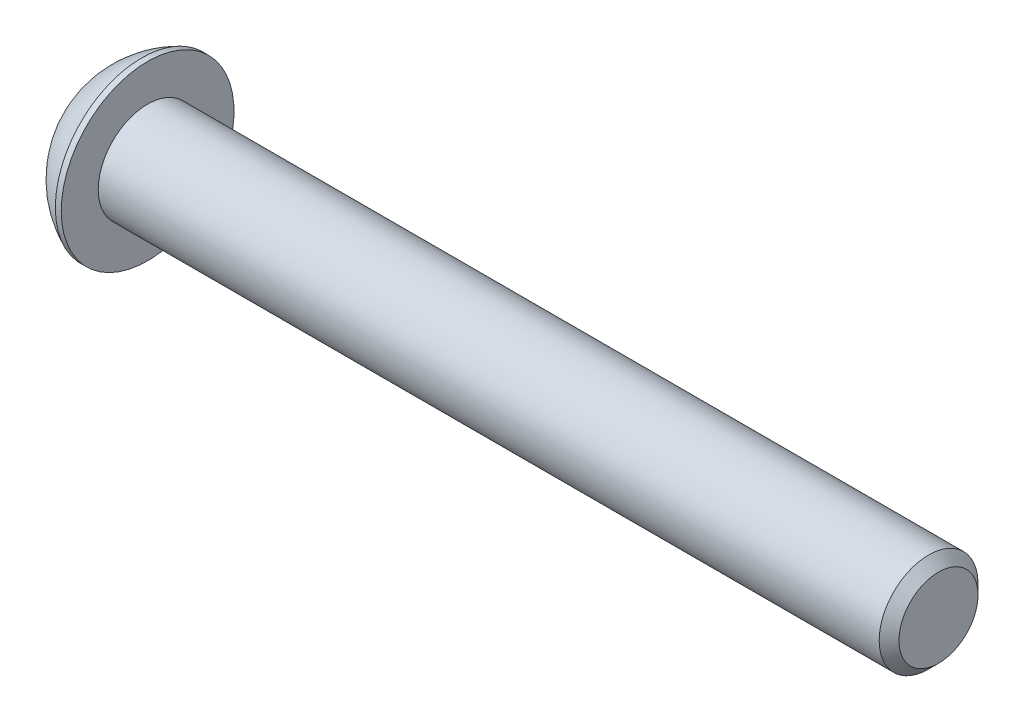
ISO-10303-21;
HEADER;
FILE_DESCRIPTION(('STEP AP214'),'2;1');
FILE_NAME('part.step','',(''),(''),'','','');
FILE_SCHEMA(('AUTOMOTIVE_DESIGN { 1 0 10303 214 1 1 1 1 }'));
ENDSEC;
DATA;
#1=APPLICATION_CONTEXT('core data for automotive mechanical design processes');
#2=APPLICATION_PROTOCOL_DEFINITION('international standard','automotive_design',2000,#1);
#3=PRODUCT_CONTEXT('',#1,'mechanical');
#4=PRODUCT('Part','Part','',(#3));
#5=PRODUCT_RELATED_PRODUCT_CATEGORY('part','',(#4));
#6=PRODUCT_DEFINITION_FORMATION('','',#4);
#7=PRODUCT_DEFINITION_CONTEXT('part definition',#1,'design');
#8=PRODUCT_DEFINITION('design','',#6,#7);
#9=PRODUCT_DEFINITION_SHAPE('','',#8);
#10=(LENGTH_UNIT() NAMED_UNIT(*) SI_UNIT(.MILLI.,.METRE.));
#11=(NAMED_UNIT(*) PLANE_ANGLE_UNIT() SI_UNIT($,.RADIAN.));
#12=(NAMED_UNIT(*) SI_UNIT($,.STERADIAN.) SOLID_ANGLE_UNIT());
#13=UNCERTAINTY_MEASURE_WITH_UNIT(LENGTH_MEASURE(1.E-05),#10,'distance_accuracy_value','');
#14=(GEOMETRIC_REPRESENTATION_CONTEXT(3) GLOBAL_UNCERTAINTY_ASSIGNED_CONTEXT((#13)) GLOBAL_UNIT_ASSIGNED_CONTEXT((#10,
#11,#12)) REPRESENTATION_CONTEXT('',''));
#15=CARTESIAN_POINT('',(0.,0.,0.));
#16=DIRECTION('',(0.,0.,1.));
#17=DIRECTION('',(1.,0.,0.));
#18=AXIS2_PLACEMENT_3D('',#15,#16,#17);
#19=CARTESIAN_POINT('',(1.32080000000034,0.,0.));
#20=DIRECTION('',(-1.,0.,0.));
#21=DIRECTION('',(0.,0.,1.));
#22=AXIS2_PLACEMENT_3D('',#19,#20,#21);
#23=CONICAL_SURFACE('',#22,1.1937999999998,1.04719755119608);
#24=CARTESIAN_POINT('',(2.01004075135902,0.,-4.44089209850063E-13));
#25=VERTEX_POINT('',#24);
#26=VERTEX_LOOP('',#25);
#27=FACE_BOUND('',#26,.T.);
#28=CARTESIAN_POINT('',(1.32080000000009,0.,0.));
#29=DIRECTION('',(-1.,0.,0.));
#30=DIRECTION('',(0.,0.,1.));
#31=AXIS2_PLACEMENT_3D('',#28,#29,#30);
#32=CIRCLE('',#31,1.19380000000024);
#33=CARTESIAN_POINT('',(1.32080000000009,0.,1.19380000000024));
#34=VERTEX_POINT('',#33);
#35=EDGE_CURVE('E20',#34,#34,#32,.T.);
#36=ORIENTED_EDGE('',*,*,#35,.T.);
#37=EDGE_LOOP('',(#36));
#38=FACE_BOUND('',#37,.T.);
#39=ADVANCED_FACE('F17',(#27,#38),#23,.F.);
#40=CARTESIAN_POINT('',(1.3208,-2.29135888084633,0.));
#41=DIRECTION('',(1.,0.,0.));
#42=DIRECTION('',(0.,0.,-1.));
#43=AXIS2_PLACEMENT_3D('',#40,#41,#42);
#44=PLANE('',#43);
#45=DIRECTION('',(0.,1.,0.));
#46=VECTOR('',#45,1.);
#47=CARTESIAN_POINT('',(1.3208,-1.14567944042316,1.984375));
#48=LINE('',#47,#46);
#49=CARTESIAN_POINT('',(1.3208,1.14567944042316,1.984375));
#50=VERTEX_POINT('',#49);
#51=CARTESIAN_POINT('',(1.3208,-1.14567944042316,1.984375));
#52=VERTEX_POINT('',#51);
#53=EDGE_CURVE('E69',#50,#52,#48,.F.);
#54=ORIENTED_EDGE('',*,*,#53,.F.);
#55=DIRECTION('',(0.,0.5,-0.866025403784439));
#56=VECTOR('',#55,1.);
#57=CARTESIAN_POINT('',(1.3208,1.14567944042316,1.984375));
#58=LINE('',#57,#56);
#59=CARTESIAN_POINT('',(1.3208,2.29135888084633,0.));
#60=VERTEX_POINT('',#59);
#61=EDGE_CURVE('E287',#60,#50,#58,.F.);
#62=ORIENTED_EDGE('',*,*,#61,.F.);
#63=DIRECTION('',(0.,-0.5,-0.866025403784439));
#64=VECTOR('',#63,1.);
#65=CARTESIAN_POINT('',(1.3208,2.29135888084633,0.));
#66=LINE('',#65,#64);
#67=CARTESIAN_POINT('',(1.3208,1.14567944042316,-1.984375));
#68=VERTEX_POINT('',#67);
#69=EDGE_CURVE('E291',#68,#60,#66,.F.);
#70=ORIENTED_EDGE('',*,*,#69,.F.);
#71=DIRECTION('',(0.,1.,0.));
#72=VECTOR('',#71,1.);
#73=CARTESIAN_POINT('',(1.3208,1.14567944042316,-1.984375));
#74=LINE('',#73,#72);
#75=CARTESIAN_POINT('',(1.3208,-1.14567944042316,-1.984375));
#76=VERTEX_POINT('',#75);
#77=EDGE_CURVE('E296',#76,#68,#74,.T.);
#78=ORIENTED_EDGE('',*,*,#77,.F.);
#79=DIRECTION('',(0.,-0.500000000000001,0.866025403784438));
#80=VECTOR('',#79,1.);
#81=CARTESIAN_POINT('',(1.3208,-1.14567944042316,-1.984375));
#82=LINE('',#81,#80);
#83=CARTESIAN_POINT('',(1.3208,-2.29135888084633,0.));
#84=VERTEX_POINT('',#83);
#85=EDGE_CURVE('E301',#84,#76,#82,.F.);
#86=ORIENTED_EDGE('',*,*,#85,.F.);
#87=DIRECTION('',(0.,0.500000000000001,0.866025403784438));
#88=VECTOR('',#87,1.);
#89=CARTESIAN_POINT('',(1.3208,-2.29135888084633,0.));
#90=LINE('',#89,#88);
#91=EDGE_CURVE('E82',#52,#84,#90,.F.);
#92=ORIENTED_EDGE('',*,*,#91,.F.);
#93=EDGE_LOOP('',(#54,#62,#70,#78,#86,#92));
#94=FACE_BOUND('',#93,.T.);
#95=ORIENTED_EDGE('',*,*,#35,.F.);
#96=EDGE_LOOP('',(#95));
#97=FACE_BOUND('',#96,.T.);
#98=ADVANCED_FACE('F75',(#94,#97),#44,.F.);
#99=CARTESIAN_POINT('',(1.3208,-1.14567944042316,1.984375));
#100=DIRECTION('',(0.,0.,-1.));
#101=DIRECTION('',(0.,1.,0.));
#102=AXIS2_PLACEMENT_3D('',#99,#100,#101);
#103=PLANE('',#102);
#104=ORIENTED_EDGE('',*,*,#53,.T.);
#105=DIRECTION('',(1.,0.,0.));
#106=VECTOR('',#105,1.);
#107=CARTESIAN_POINT('',(1.3208,-1.14567944042316,1.984375));
#108=LINE('',#107,#106);
#109=CARTESIAN_POINT('',(0.,-1.14567944042316,1.984375));
#110=VERTEX_POINT('',#109);
#111=EDGE_CURVE('E79',#110,#52,#108,.T.);
#112=ORIENTED_EDGE('',*,*,#111,.F.);
#113=DIRECTION('',(0.,1.,0.));
#114=VECTOR('',#113,1.);
#115=CARTESIAN_POINT('',(0.,0.,1.984375));
#116=LINE('',#115,#114);
#117=CARTESIAN_POINT('',(0.,1.14567944042316,1.984375));
#118=VERTEX_POINT('',#117);
#119=EDGE_CURVE('E281',#118,#110,#116,.F.);
#120=ORIENTED_EDGE('',*,*,#119,.F.);
#121=DIRECTION('',(1.,0.,0.));
#122=VECTOR('',#121,1.);
#123=CARTESIAN_POINT('',(1.3208,1.14567944042316,1.984375));
#124=LINE('',#123,#122);
#125=EDGE_CURVE('E284',#50,#118,#124,.F.);
#126=ORIENTED_EDGE('',*,*,#125,.F.);
#127=EDGE_LOOP('',(#104,#112,#120,#126));
#128=FACE_BOUND('',#127,.T.);
#129=ADVANCED_FACE('F128',(#128),#103,.T.);
#130=CARTESIAN_POINT('',(1.3208,-2.29135888084633,0.));
#131=DIRECTION('',(0.,0.866025403784438,-0.500000000000001));
#132=DIRECTION('',(0.,0.500000000000001,0.866025403784438));
#133=AXIS2_PLACEMENT_3D('',#130,#131,#132);
#134=PLANE('',#133);
#135=ORIENTED_EDGE('',*,*,#91,.T.);
#136=DIRECTION('',(1.,0.,0.));
#137=VECTOR('',#136,1.);
#138=CARTESIAN_POINT('',(1.3208,-2.29135888084633,0.));
#139=LINE('',#138,#137);
#140=CARTESIAN_POINT('',(0.,-2.29135888084633,0.));
#141=VERTEX_POINT('',#140);
#142=EDGE_CURVE('E303',#141,#84,#139,.T.);
#143=ORIENTED_EDGE('',*,*,#142,.F.);
#144=DIRECTION('',(0.,-0.500000000000001,-0.866025403784438));
#145=VECTOR('',#144,1.);
#146=CARTESIAN_POINT('',(0.,-1.14567944042316,1.984375));
#147=LINE('',#146,#145);
#148=EDGE_CURVE('E278',#110,#141,#147,.T.);
#149=ORIENTED_EDGE('',*,*,#148,.F.);
#150=ORIENTED_EDGE('',*,*,#111,.T.);
#151=EDGE_LOOP('',(#135,#143,#149,#150));
#152=FACE_BOUND('',#151,.T.);
#153=ADVANCED_FACE('F124',(#152),#134,.T.);
#154=CARTESIAN_POINT('',(1.3208,-1.14567944042316,-1.984375));
#155=DIRECTION('',(0.,0.866025403784438,0.500000000000001));
#156=DIRECTION('',(0.,-0.500000000000001,0.866025403784438));
#157=AXIS2_PLACEMENT_3D('',#154,#155,#156);
#158=PLANE('',#157);
#159=ORIENTED_EDGE('',*,*,#85,.T.);
#160=DIRECTION('',(1.,0.,0.));
#161=VECTOR('',#160,1.);
#162=CARTESIAN_POINT('',(1.3208,-1.14567944042316,-1.984375));
#163=LINE('',#162,#161);
#164=CARTESIAN_POINT('',(0.,-1.14567944042316,-1.984375));
#165=VERTEX_POINT('',#164);
#166=EDGE_CURVE('E298',#165,#76,#163,.T.);
#167=ORIENTED_EDGE('',*,*,#166,.F.);
#168=DIRECTION('',(0.,0.500000000000001,-0.866025403784438));
#169=VECTOR('',#168,1.);
#170=CARTESIAN_POINT('',(0.,-2.29135888084633,0.));
#171=LINE('',#170,#169);
#172=EDGE_CURVE('E275',#141,#165,#171,.T.);
#173=ORIENTED_EDGE('',*,*,#172,.F.);
#174=ORIENTED_EDGE('',*,*,#142,.T.);
#175=EDGE_LOOP('',(#159,#167,#173,#174));
#176=FACE_BOUND('',#175,.T.);
#177=ADVANCED_FACE('F120',(#176),#158,.T.);
#178=CARTESIAN_POINT('',(1.3208,1.14567944042316,-1.984375));
#179=DIRECTION('',(0.,0.,1.));
#180=DIRECTION('',(1.,0.,0.));
#181=AXIS2_PLACEMENT_3D('',#178,#179,#180);
#182=PLANE('',#181);
#183=ORIENTED_EDGE('',*,*,#77,.T.);
#184=DIRECTION('',(1.,0.,0.));
#185=VECTOR('',#184,1.);
#186=CARTESIAN_POINT('',(1.3208,1.14567944042316,-1.984375));
#187=LINE('',#186,#185);
#188=CARTESIAN_POINT('',(0.,1.14567944042316,-1.984375));
#189=VERTEX_POINT('',#188);
#190=EDGE_CURVE('E293',#189,#68,#187,.T.);
#191=ORIENTED_EDGE('',*,*,#190,.F.);
#192=DIRECTION('',(0.,1.,0.));
#193=VECTOR('',#192,1.);
#194=CARTESIAN_POINT('',(0.,0.,-1.984375));
#195=LINE('',#194,#193);
#196=EDGE_CURVE('E272',#165,#189,#195,.T.);
#197=ORIENTED_EDGE('',*,*,#196,.F.);
#198=ORIENTED_EDGE('',*,*,#166,.T.);
#199=EDGE_LOOP('',(#183,#191,#197,#198));
#200=FACE_BOUND('',#199,.T.);
#201=ADVANCED_FACE('F117',(#200),#182,.T.);
#202=CARTESIAN_POINT('',(1.3208,2.29135888084633,0.));
#203=DIRECTION('',(0.,-0.866025403784439,0.5));
#204=DIRECTION('',(0.,-0.5,-0.866025403784439));
#205=AXIS2_PLACEMENT_3D('',#202,#203,#204);
#206=PLANE('',#205);
#207=ORIENTED_EDGE('',*,*,#69,.T.);
#208=DIRECTION('',(1.,0.,0.));
#209=VECTOR('',#208,1.);
#210=CARTESIAN_POINT('',(1.3208,2.29135888084633,0.));
#211=LINE('',#210,#209);
#212=CARTESIAN_POINT('',(0.,2.29135888084633,0.));
#213=VERTEX_POINT('',#212);
#214=EDGE_CURVE('E35',#213,#60,#211,.T.);
#215=ORIENTED_EDGE('',*,*,#214,.F.);
#216=DIRECTION('',(0.,0.5,0.866025403784439));
#217=VECTOR('',#216,1.);
#218=CARTESIAN_POINT('',(0.,1.14567944042316,-1.984375));
#219=LINE('',#218,#217);
#220=EDGE_CURVE('E269',#189,#213,#219,.T.);
#221=ORIENTED_EDGE('',*,*,#220,.F.);
#222=ORIENTED_EDGE('',*,*,#190,.T.);
#223=EDGE_LOOP('',(#207,#215,#221,#222));
#224=FACE_BOUND('',#223,.T.);
#225=ADVANCED_FACE('F113',(#224),#206,.T.);
#226=CARTESIAN_POINT('',(1.3208,1.14567944042316,1.984375));
#227=DIRECTION('',(0.,-0.866025403784439,-0.5));
#228=DIRECTION('',(0.,0.5,-0.866025403784439));
#229=AXIS2_PLACEMENT_3D('',#226,#227,#228);
#230=PLANE('',#229);
#231=ORIENTED_EDGE('',*,*,#61,.T.);
#232=ORIENTED_EDGE('',*,*,#125,.T.);
#233=DIRECTION('',(0.,-0.5,0.866025403784438));
#234=VECTOR('',#233,1.);
#235=CARTESIAN_POINT('',(0.,2.29135888084633,0.));
#236=LINE('',#235,#234);
#237=EDGE_CURVE('E100',#213,#118,#236,.T.);
#238=ORIENTED_EDGE('',*,*,#237,.F.);
#239=ORIENTED_EDGE('',*,*,#214,.T.);
#240=EDGE_LOOP('',(#231,#232,#238,#239));
#241=FACE_BOUND('',#240,.T.);
#242=ADVANCED_FACE('F109',(#241),#230,.T.);
#243=CARTESIAN_POINT('',(0.,0.,0.));
#244=DIRECTION('',(-1.,0.,0.));
#245=DIRECTION('',(0.,0.,1.));
#246=AXIS2_PLACEMENT_3D('',#243,#244,#245);
#247=PLANE('',#246);
#248=ORIENTED_EDGE('',*,*,#220,.T.);
#249=ORIENTED_EDGE('',*,*,#237,.T.);
#250=ORIENTED_EDGE('',*,*,#119,.T.);
#251=ORIENTED_EDGE('',*,*,#148,.T.);
#252=ORIENTED_EDGE('',*,*,#172,.T.);
#253=ORIENTED_EDGE('',*,*,#196,.T.);
#254=EDGE_LOOP('',(#248,#249,#250,#251,#252,#253));
#255=FACE_BOUND('',#254,.T.);
#256=CARTESIAN_POINT('',(0.,2.77495,0.));
#257=CARTESIAN_POINT('',(0.,2.77494953309947,0.0779118937523459));
#258=CARTESIAN_POINT('',(0.,2.77166578388025,0.15583810591977));
#259=CARTESIAN_POINT('',(0.,2.75855213600204,0.311152012455904));
#260=CARTESIAN_POINT('',(0.,2.74872030471467,0.388539541019556));
#261=CARTESIAN_POINT('',(0.,2.72255472645676,0.542341518735717));
#262=CARTESIAN_POINT('',(-2.70414110576258E-13,2.70621065843663,0.618754223567578));
#263=CARTESIAN_POINT('',(2.71501725221868E-13,2.66713326915777,0.769973634286023));
#264=CARTESIAN_POINT('',(1.01274952524446E-12,2.64439476297869,0.844778983646282));
#265=CARTESIAN_POINT('',(1.81909959813207E-12,2.56690195943351,1.06566239301792));
#266=CARTESIAN_POINT('',(4.77081687541822E-13,2.50280672569928,1.20857954243987));
#267=CARTESIAN_POINT('',(-4.76232447128612E-13,2.35149826934097,1.48160874561538));
#268=CARTESIAN_POINT('',(0.,2.26428416790397,1.61172031233499));
#269=CARTESIAN_POINT('',(0.,2.1181093928834,1.79445660654268));
#270=CARTESIAN_POINT('',(0.,2.06678693791626,1.85333128513996));
#271=CARTESIAN_POINT('',(0.,1.95940522984449,1.96650727912792));
#272=CARTESIAN_POINT('',(0.,1.90335059143535,2.02081294920044));
#273=CARTESIAN_POINT('',(0.,1.78683891013963,2.12453280878582));
#274=CARTESIAN_POINT('',(0.,1.72637988450322,2.1739447713554));
#275=CARTESIAN_POINT('',(0.,1.60151968865711,2.26750481692908));
#276=CARTESIAN_POINT('',(0.,1.53711760864537,2.31165167810847));
#277=CARTESIAN_POINT('',(0.,1.33869902291632,2.43567242603944));
#278=CARTESIAN_POINT('',(0.,1.19934704110695,2.507235886628));
#279=CARTESIAN_POINT('',(0.,0.910681609121881,2.62590828672821));
#280=CARTESIAN_POINT('',(0.,0.761368265357398,2.67301748742278));
#281=CARTESIAN_POINT('',(0.,0.456932649466623,2.74151230664007));
#282=CARTESIAN_POINT('',(0.,0.301810346322584,2.76289778778721));
#283=CARTESIAN_POINT('',(0.,-0.00982263870895171,2.77931595661156));
#284=CARTESIAN_POINT('',(0.,-0.166333320596448,2.77434864428877));
#285=CARTESIAN_POINT('',(0.,-0.476280836814452,2.73822217653073));
#286=CARTESIAN_POINT('',(0.,-0.629717687555985,2.70706316096981));
#287=CARTESIAN_POINT('',(0.,-0.929254830044274,2.61937980771149));
#288=CARTESIAN_POINT('',(0.,-1.0753550434132,2.56285519909568));
#289=CARTESIAN_POINT('',(0.,-1.28570692598579,2.46037024128109));
#290=CARTESIAN_POINT('',(0.,-1.35439130022287,2.42323494812896));
#291=CARTESIAN_POINT('',(0.,-1.488391287199,2.34331277270256));
#292=CARTESIAN_POINT('',(0.,-1.55370767631787,2.30052720108831));
#293=CARTESIAN_POINT('',(0.,-1.68047292776594,2.20962421887055));
#294=CARTESIAN_POINT('',(0.,-1.7419235278682,2.16150923122348));
#295=CARTESIAN_POINT('',(0.,-1.86060297067992,2.06024311301283));
#296=CARTESIAN_POINT('',(0.,-1.91782768181715,2.0070871669763));
#297=CARTESIAN_POINT('',(0.,-2.08239462196651,1.8407220856554));
#298=CARTESIAN_POINT('',(0.,-2.18279764272601,1.72049499758422));
#299=CARTESIAN_POINT('',(0.,-2.36195754944063,1.46487629213018));
#300=CARTESIAN_POINT('',(0.,-2.44071525816758,1.32948525142807));
#301=CARTESIAN_POINT('',(0.,-2.54098882695274,1.11796734074395));
#302=CARTESIAN_POINT('',(0.,-2.57146177392727,1.04596540008347));
#303=CARTESIAN_POINT('',(0.,-2.62621251108999,0.899689259475764));
#304=CARTESIAN_POINT('',(0.,-2.65049531495563,0.825416953360952));
#305=CARTESIAN_POINT('',(0.,-2.69267708798766,0.675215808695207));
#306=CARTESIAN_POINT('',(0.,-2.71058613777937,0.599289789313092));
#307=CARTESIAN_POINT('',(0.,-2.73994710360127,0.446213628496932));
#308=CARTESIAN_POINT('',(0.,-2.75140092413871,0.369063855024788));
#309=CARTESIAN_POINT('',(0.,-2.76470470685522,0.24316208817343));
#310=CARTESIAN_POINT('',(0.,-2.76854547596618,0.194611672428577));
#311=CARTESIAN_POINT('',(0.,-2.77366826843264,0.0973760351839812));
#312=CARTESIAN_POINT('',(0.,-2.77495029178814,0.0486908136842395));
#313=CARTESIAN_POINT('',(0.,-2.77494953309947,-0.0779118937523475));
#314=CARTESIAN_POINT('',(0.,-2.77166578388025,-0.155838105919772));
#315=CARTESIAN_POINT('',(0.,-2.75855213600204,-0.311152012455906));
#316=CARTESIAN_POINT('',(0.,-2.74872030471467,-0.388539541019558));
#317=CARTESIAN_POINT('',(0.,-2.72255472645677,-0.542341518735719));
#318=CARTESIAN_POINT('',(-2.70149297926331E-13,-2.70621065843663,-0.61875422356758));
#319=CARTESIAN_POINT('',(2.712366972268E-13,-2.66713326915777,-0.769973634286024));
#320=CARTESIAN_POINT('',(1.0114146773846E-12,-2.64439476297869,-0.844778983646283));
#321=CARTESIAN_POINT('',(1.81656702958366E-12,-2.5669019594335,-1.06566239301792));
#322=CARTESIAN_POINT('',(4.7641829195856E-13,-2.50280672569928,-1.20857954243988));
#323=CARTESIAN_POINT('',(-4.75569026324205E-13,-2.35149826934097,-1.48160874561538));
#324=CARTESIAN_POINT('',(0.,-2.26428416790396,-1.61172031233499));
#325=CARTESIAN_POINT('',(0.,-2.1181093928834,-1.79445660654268));
#326=CARTESIAN_POINT('',(0.,-2.06678693791626,-1.85333128513997));
#327=CARTESIAN_POINT('',(0.,-1.95940522984449,-1.96650727912792));
#328=CARTESIAN_POINT('',(0.,-1.90335059143535,-2.02081294920044));
#329=CARTESIAN_POINT('',(0.,-1.78683891013963,-2.12453280878582));
#330=CARTESIAN_POINT('',(0.,-1.72637988450322,-2.1739447713554));
#331=CARTESIAN_POINT('',(0.,-1.60151968865711,-2.26750481692908));
#332=CARTESIAN_POINT('',(0.,-1.53711760864537,-2.31165167810847));
#333=CARTESIAN_POINT('',(0.,-1.33869902291632,-2.43567242603944));
#334=CARTESIAN_POINT('',(0.,-1.19934704110695,-2.507235886628));
#335=CARTESIAN_POINT('',(0.,-0.91068160912188,-2.62590828672821));
#336=CARTESIAN_POINT('',(0.,-0.761368265357396,-2.67301748742278));
#337=CARTESIAN_POINT('',(0.,-0.456932649466621,-2.74151230664007));
#338=CARTESIAN_POINT('',(0.,-0.301810346322582,-2.76289778778721));
#339=CARTESIAN_POINT('',(0.,0.00982263870895353,-2.77931595661156));
#340=CARTESIAN_POINT('',(0.,0.16633332059645,-2.77434864428876));
#341=CARTESIAN_POINT('',(0.,0.476280836814454,-2.73822217653073));
#342=CARTESIAN_POINT('',(0.,0.629717687555987,-2.70706316096981));
#343=CARTESIAN_POINT('',(0.,0.929254830044276,-2.6193798077115));
#344=CARTESIAN_POINT('',(0.,1.0753550434132,-2.56285519909568));
#345=CARTESIAN_POINT('',(0.,1.28570692598579,-2.46037024128109));
#346=CARTESIAN_POINT('',(0.,1.35439130022287,-2.42323494812896));
#347=CARTESIAN_POINT('',(0.,1.488391287199,-2.34331277270256));
#348=CARTESIAN_POINT('',(0.,1.55370767631787,-2.30052720108831));
#349=CARTESIAN_POINT('',(0.,1.68047292776594,-2.20962421887055));
#350=CARTESIAN_POINT('',(0.,1.7419235278682,-2.16150923122348));
#351=CARTESIAN_POINT('',(0.,1.86060297067992,-2.06024311301282));
#352=CARTESIAN_POINT('',(0.,1.91782768181716,-2.0070871669763));
#353=CARTESIAN_POINT('',(0.,2.08239462196651,-1.8407220856554));
#354=CARTESIAN_POINT('',(0.,2.18279764272601,-1.72049499758422));
#355=CARTESIAN_POINT('',(0.,2.36195754944063,-1.46487629213018));
#356=CARTESIAN_POINT('',(0.,2.44071525816757,-1.32948525142807));
#357=CARTESIAN_POINT('',(0.,2.54098882695273,-1.11796734074395));
#358=CARTESIAN_POINT('',(0.,2.57146177392727,-1.04596540008347));
#359=CARTESIAN_POINT('',(0.,2.62621251108999,-0.899689259475765));
#360=CARTESIAN_POINT('',(0.,2.65049531495563,-0.825416953360953));
#361=CARTESIAN_POINT('',(0.,2.69267708798766,-0.675215808695207));
#362=CARTESIAN_POINT('',(0.,2.71058613777936,-0.599289789313092));
#363=CARTESIAN_POINT('',(0.,2.73994710360127,-0.446213628496932));
#364=CARTESIAN_POINT('',(0.,2.75140092413871,-0.369063855024789));
#365=CARTESIAN_POINT('',(0.,2.76470470685522,-0.243162088173432));
#366=CARTESIAN_POINT('',(0.,2.76854547596618,-0.194611672428578));
#367=CARTESIAN_POINT('',(0.,2.77366826843264,-0.0973760351839823));
#368=CARTESIAN_POINT('',(0.,2.77495029178814,-0.0486908136842408));
#369=CARTESIAN_POINT('',(0.,2.77495,0.));
#370=B_SPLINE_CURVE_WITH_KNOTS('',3,(#256,#257,#258,#259,#260,#261,#262,#263,#264,#265,#266,
#267,#268,#269,#270,#271,#272,#273,#274,#275,#276,#277,#278,#279,#280,#281,#282,#283,#284,#285,
#286,#287,#288,#289,#290,#291,#292,#293,#294,#295,#296,#297,#298,#299,#300,#301,#302,#303,#304,
#305,#306,#307,#308,#309,#310,#311,#312,#313,#314,#315,#316,#317,#318,#319,#320,#321,#322,#323,
#324,#325,#326,#327,#328,#329,#330,#331,#332,#333,#334,#335,#336,#337,#338,#339,#340,#341,#342,
#343,#344,#345,#346,#347,#348,#349,#350,#351,#352,#353,#354,#355,#356,#357,#358,#359,#360,#361,
#362,#363,#364,#365,#366,#367,#368,#369),.UNSPECIFIED.,.T.,.F.,(4,2,2,2,2,2,2,2,2,2,2,2,2,2,2,2,
2,2,2,2,2,2,2,2,2,2,2,2,2,2,2,2,2,2,2,2,2,2,2,2,2,2,2,2,2,2,2,2,2,2,2,2,2,2,2,2,4),(0.,
0.233690856748162,0.467450716578751,0.701582538521471,0.935904756015414,1.40343220467667,
1.87097742791502,2.10505636898837,2.33890962270652,2.57286880998746,2.80688218486306,
3.27442101763127,3.74195485676357,4.20949119271389,4.67702752866417,5.14456136779641,
5.61210020056468,5.84611357544033,6.08007276272136,6.31392601643949,6.54800495751273,
7.01555018075072,7.48307762941212,7.71739984690652,7.95153166884955,8.18529152868023,
8.41898238542855,8.56502681353347,8.71107124163843,8.94476209838659,9.17852195821718,
9.4126537801599,9.64697599765384,10.1145034463151,10.5820486695534,10.8161276106268,
11.0499808643449,11.2839400516259,11.5179534265015,11.9854922592697,12.453026098402,
12.9205624343523,13.3880987703026,13.8556326094348,14.3231714422031,14.5571848170788,
14.7911440043598,15.0249972580779,15.2590761991512,15.7266214223891,16.1941488710506,
16.4284710885449,16.662602910488,16.8963627703186,17.130053627067,17.2760980551719,
17.4221424832769),.UNSPECIFIED.);
#371=CARTESIAN_POINT('',(0.,2.77495,0.));
#372=VERTEX_POINT('',#371);
#373=EDGE_CURVE('E94',#372,#372,#370,.T.);
#374=ORIENTED_EDGE('',*,*,#373,.F.);
#375=EDGE_LOOP('',(#374));
#376=FACE_BOUND('',#375,.T.);
#377=ADVANCED_FACE('F105',(#255,#376),#247,.T.);
#378=CARTESIAN_POINT('',(5.37260881410256,0.,0.));
#379=DIRECTION('',(0.,1.,0.));
#380=DIRECTION('',(1.,0.,0.));
#381=AXIS2_PLACEMENT_3D('',#378,#379,#380);
#382=SPHERICAL_SURFACE('',#381,6.04692260342999);
#383=CARTESIAN_POINT('',(2.9718,0.,0.));
#384=DIRECTION('',(-1.,0.,0.));
#385=DIRECTION('',(0.,0.,1.));
#386=AXIS2_PLACEMENT_3D('',#383,#384,#385);
#387=CIRCLE('',#386,5.5499);
#388=CARTESIAN_POINT('',(2.9718,0.,5.5499));
#389=VERTEX_POINT('',#388);
#390=EDGE_CURVE('E92',#389,#389,#387,.F.);
#391=ORIENTED_EDGE('',*,*,#390,.F.);
#392=EDGE_LOOP('',(#391));
#393=FACE_BOUND('',#392,.T.);
#394=ORIENTED_EDGE('',*,*,#373,.T.);
#395=EDGE_LOOP('',(#394));
#396=FACE_BOUND('',#395,.T.);
#397=ADVANCED_FACE('F101',(#393,#396),#382,.T.);
#398=CARTESIAN_POINT('',(54.1528,0.,0.));
#399=DIRECTION('',(-1.,0.,0.));
#400=DIRECTION('',(0.,0.,1.));
#401=AXIS2_PLACEMENT_3D('',#398,#399,#400);
#402=PLANE('',#401);
#403=CARTESIAN_POINT('',(54.152800000054,0.,0.));
#404=DIRECTION('',(-1.,0.,0.));
#405=DIRECTION('',(0.,-1.,0.));
#406=AXIS2_PLACEMENT_3D('',#403,#404,#405);
#407=CIRCLE('',#406,2.53999999995358);
#408=CARTESIAN_POINT('',(54.152800000054,-2.53999999995358,0.));
#409=VERTEX_POINT('',#408);
#410=EDGE_CURVE('E89',#409,#409,#407,.T.);
#411=ORIENTED_EDGE('',*,*,#410,.F.);
#412=EDGE_LOOP('',(#411));
#413=FACE_BOUND('',#412,.T.);
#414=ADVANCED_FACE('F154',(#413),#402,.F.);
#415=CARTESIAN_POINT('',(0.,0.,0.));
#416=DIRECTION('',(-1.,0.,0.));
#417=DIRECTION('',(0.,0.,1.));
#418=AXIS2_PLACEMENT_3D('',#415,#416,#417);
#419=CYLINDRICAL_SURFACE('',#418,5.5499);
#420=ORIENTED_EDGE('',*,*,#390,.T.);
#421=EDGE_LOOP('',(#420));
#422=FACE_BOUND('',#421,.T.);
#423=CARTESIAN_POINT('',(3.3528,0.,0.));
#424=DIRECTION('',(-1.,0.,0.));
#425=DIRECTION('',(0.,0.,1.));
#426=AXIS2_PLACEMENT_3D('',#423,#424,#425);
#427=CIRCLE('',#426,5.5499);
#428=CARTESIAN_POINT('',(3.3528,0.,5.5499));
#429=VERTEX_POINT('',#428);
#430=EDGE_CURVE('E86',#429,#429,#427,.T.);
#431=ORIENTED_EDGE('',*,*,#430,.T.);
#432=EDGE_LOOP('',(#431));
#433=FACE_BOUND('',#432,.T.);
#434=ADVANCED_FACE('F151',(#422,#433),#419,.T.);
#435=CARTESIAN_POINT('',(53.5178000001224,0.,0.));
#436=DIRECTION('',(-1.,0.,0.));
#437=DIRECTION('',(0.,-1.,0.));
#438=AXIS2_PLACEMENT_3D('',#435,#436,#437);
#439=CONICAL_SURFACE('',#438,3.17499999988513,0.785398163397448);
#440=CARTESIAN_POINT('',(53.5178,0.,0.));
#441=DIRECTION('',(-1.,0.,0.));
#442=DIRECTION('',(0.,0.,1.));
#443=AXIS2_PLACEMENT_3D('',#440,#441,#442);
#444=CIRCLE('',#443,3.175);
#445=CARTESIAN_POINT('',(53.5178,0.,3.175));
#446=VERTEX_POINT('',#445);
#447=EDGE_CURVE('E26',#446,#446,#444,.T.);
#448=ORIENTED_EDGE('',*,*,#447,.F.);
#449=EDGE_LOOP('',(#448));
#450=FACE_BOUND('',#449,.T.);
#451=ORIENTED_EDGE('',*,*,#410,.T.);
#452=EDGE_LOOP('',(#451));
#453=FACE_BOUND('',#452,.T.);
#454=ADVANCED_FACE('F144',(#450,#453),#439,.T.);
#455=CARTESIAN_POINT('',(3.3528,3.175,0.));
#456=DIRECTION('',(-1.,0.,0.));
#457=DIRECTION('',(0.,0.,1.));
#458=AXIS2_PLACEMENT_3D('',#455,#456,#457);
#459=PLANE('',#458);
#460=CARTESIAN_POINT('',(3.3528,0.,0.));
#461=DIRECTION('',(-1.,0.,0.));
#462=DIRECTION('',(0.,0.,1.));
#463=AXIS2_PLACEMENT_3D('',#460,#461,#462);
#464=CIRCLE('',#463,3.175);
#465=CARTESIAN_POINT('',(3.3528,0.,3.175));
#466=VERTEX_POINT('',#465);
#467=EDGE_CURVE('E11',#466,#466,#464,.F.);
#468=ORIENTED_EDGE('',*,*,#467,.F.);
#469=EDGE_LOOP('',(#468));
#470=FACE_BOUND('',#469,.T.);
#471=ORIENTED_EDGE('',*,*,#430,.F.);
#472=EDGE_LOOP('',(#471));
#473=FACE_BOUND('',#472,.T.);
#474=ADVANCED_FACE('F138',(#470,#473),#459,.F.);
#475=CARTESIAN_POINT('',(0.,0.,0.));
#476=DIRECTION('',(-1.,0.,0.));
#477=DIRECTION('',(0.,0.,1.));
#478=AXIS2_PLACEMENT_3D('',#475,#476,#477);
#479=CYLINDRICAL_SURFACE('',#478,3.175);
#480=ORIENTED_EDGE('',*,*,#467,.T.);
#481=EDGE_LOOP('',(#480));
#482=FACE_BOUND('',#481,.T.);
#483=ORIENTED_EDGE('',*,*,#447,.T.);
#484=EDGE_LOOP('',(#483));
#485=FACE_BOUND('',#484,.T.);
#486=ADVANCED_FACE('F136',(#482,#485),#479,.T.);
#487=CLOSED_SHELL('',(#39,#98,#129,#153,#177,#201,#225,#242,#377,#397,#414,#434,#454,#474,#486));
#488=MANIFOLD_SOLID_BREP('B1',#487);
#489=ADVANCED_BREP_SHAPE_REPRESENTATION('',(#18,#488),#14);
#490=SHAPE_DEFINITION_REPRESENTATION(#9,#489);
ENDSEC;
END-ISO-10303-21;
